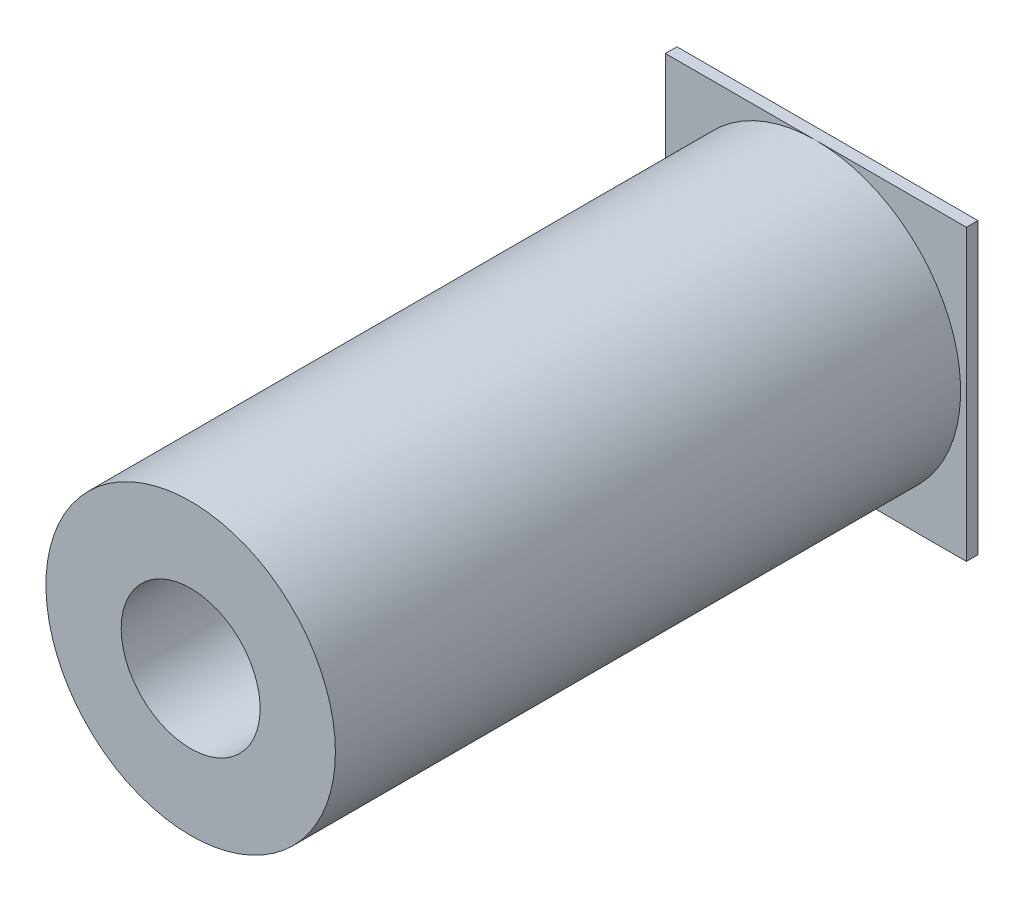
ISO-10303-21;
HEADER;
FILE_DESCRIPTION(('STEP AP214'),'2;1');
FILE_NAME('part.step','',(''),(''),'','','');
FILE_SCHEMA(('AUTOMOTIVE_DESIGN { 1 0 10303 214 1 1 1 1 }'));
ENDSEC;
DATA;
#1=APPLICATION_CONTEXT('core data for automotive mechanical design processes');
#2=APPLICATION_PROTOCOL_DEFINITION('international standard','automotive_design',2000,#1);
#3=PRODUCT_CONTEXT('',#1,'mechanical');
#4=PRODUCT('Part','Part','',(#3));
#5=PRODUCT_RELATED_PRODUCT_CATEGORY('part','',(#4));
#6=PRODUCT_DEFINITION_FORMATION('','',#4);
#7=PRODUCT_DEFINITION_CONTEXT('part definition',#1,'design');
#8=PRODUCT_DEFINITION('design','',#6,#7);
#9=PRODUCT_DEFINITION_SHAPE('','',#8);
#10=(LENGTH_UNIT() NAMED_UNIT(*) SI_UNIT(.MILLI.,.METRE.));
#11=(NAMED_UNIT(*) PLANE_ANGLE_UNIT() SI_UNIT($,.RADIAN.));
#12=(NAMED_UNIT(*) SI_UNIT($,.STERADIAN.) SOLID_ANGLE_UNIT());
#13=UNCERTAINTY_MEASURE_WITH_UNIT(LENGTH_MEASURE(1.E-05),#10,'distance_accuracy_value','');
#14=(GEOMETRIC_REPRESENTATION_CONTEXT(3) GLOBAL_UNCERTAINTY_ASSIGNED_CONTEXT((#13)) GLOBAL_UNIT_ASSIGNED_CONTEXT((#10,
#11,#12)) REPRESENTATION_CONTEXT('',''));
#15=CARTESIAN_POINT('',(0.,0.,0.));
#16=DIRECTION('',(0.,0.,1.));
#17=DIRECTION('',(1.,0.,0.));
#18=AXIS2_PLACEMENT_3D('',#15,#16,#17);
#19=CARTESIAN_POINT('',(0.,0.,1.));
#20=DIRECTION('',(0.,0.,1.));
#21=DIRECTION('',(1.,0.,0.));
#22=AXIS2_PLACEMENT_3D('',#19,#20,#21);
#23=PLANE('',#22);
#24=CARTESIAN_POINT('',(0.,0.,1.));
#25=DIRECTION('',(0.,0.,1.));
#26=DIRECTION('',(1.,0.,0.));
#27=AXIS2_PLACEMENT_3D('',#24,#25,#26);
#28=CIRCLE('',#27,12.5);
#29=CARTESIAN_POINT('',(0.,12.5,1.));
#30=VERTEX_POINT('',#29);
#31=CARTESIAN_POINT('',(0.,-12.5,1.));
#32=VERTEX_POINT('',#31);
#33=EDGE_CURVE('E54',#30,#32,#28,.T.);
#34=ORIENTED_EDGE('',*,*,#33,.F.);
#35=DIRECTION('',(-1.,0.,0.));
#36=VECTOR('',#35,1.);
#37=CARTESIAN_POINT('',(-13.,12.5,1.));
#38=LINE('',#37,#36);
#39=CARTESIAN_POINT('',(-13.,12.5,1.));
#40=VERTEX_POINT('',#39);
#41=EDGE_CURVE('E102',#30,#40,#38,.T.);
#42=ORIENTED_EDGE('',*,*,#41,.T.);
#43=DIRECTION('',(0.,-1.,0.));
#44=VECTOR('',#43,1.);
#45=CARTESIAN_POINT('',(-13.,12.5,1.));
#46=LINE('',#45,#44);
#47=CARTESIAN_POINT('',(-13.,-12.5,1.));
#48=VERTEX_POINT('',#47);
#49=EDGE_CURVE('E101',#40,#48,#46,.T.);
#50=ORIENTED_EDGE('',*,*,#49,.T.);
#51=DIRECTION('',(1.,0.,0.));
#52=VECTOR('',#51,1.);
#53=CARTESIAN_POINT('',(-13.,-12.5,1.));
#54=LINE('',#53,#52);
#55=EDGE_CURVE('E115',#48,#32,#54,.T.);
#56=ORIENTED_EDGE('',*,*,#55,.T.);
#57=EDGE_LOOP('',(#34,#42,#50,#56));
#58=FACE_BOUND('',#57,.T.);
#59=ADVANCED_FACE('F43',(#58),#23,.T.);
#60=CARTESIAN_POINT('',(13.,12.5,1.));
#61=DIRECTION('',(-1.,0.,0.));
#62=DIRECTION('',(0.,-1.,0.));
#63=AXIS2_PLACEMENT_3D('',#60,#61,#62);
#64=PLANE('',#63);
#65=DIRECTION('',(0.,1.,0.));
#66=VECTOR('',#65,1.);
#67=CARTESIAN_POINT('',(13.,12.5,0.));
#68=LINE('',#67,#66);
#69=CARTESIAN_POINT('',(13.,-12.5,0.));
#70=VERTEX_POINT('',#69);
#71=CARTESIAN_POINT('',(13.,12.5,0.));
#72=VERTEX_POINT('',#71);
#73=EDGE_CURVE('E243',#70,#72,#68,.T.);
#74=ORIENTED_EDGE('',*,*,#73,.T.);
#75=DIRECTION('',(0.,0.,-1.));
#76=VECTOR('',#75,1.);
#77=CARTESIAN_POINT('',(13.,12.5,1.));
#78=LINE('',#77,#76);
#79=CARTESIAN_POINT('',(13.,12.5,1.));
#80=VERTEX_POINT('',#79);
#81=EDGE_CURVE('E47',#80,#72,#78,.T.);
#82=ORIENTED_EDGE('',*,*,#81,.F.);
#83=DIRECTION('',(0.,1.,0.));
#84=VECTOR('',#83,1.);
#85=CARTESIAN_POINT('',(13.,12.5,1.));
#86=LINE('',#85,#84);
#87=CARTESIAN_POINT('',(13.,-12.5,1.));
#88=VERTEX_POINT('',#87);
#89=EDGE_CURVE('E98',#88,#80,#86,.T.);
#90=ORIENTED_EDGE('',*,*,#89,.F.);
#91=DIRECTION('',(0.,0.,-1.));
#92=VECTOR('',#91,1.);
#93=CARTESIAN_POINT('',(13.,-12.5,1.));
#94=LINE('',#93,#92);
#95=EDGE_CURVE('E251',#88,#70,#94,.T.);
#96=ORIENTED_EDGE('',*,*,#95,.T.);
#97=EDGE_LOOP('',(#74,#82,#90,#96));
#98=FACE_BOUND('',#97,.T.);
#99=ADVANCED_FACE('F45',(#98),#64,.F.);
#100=CARTESIAN_POINT('',(-13.,12.5,1.));
#101=DIRECTION('',(0.,-1.,0.));
#102=DIRECTION('',(0.,0.,-1.));
#103=AXIS2_PLACEMENT_3D('',#100,#101,#102);
#104=PLANE('',#103);
#105=DIRECTION('',(-1.,0.,0.));
#106=VECTOR('',#105,1.);
#107=CARTESIAN_POINT('',(-13.,12.5,0.));
#108=LINE('',#107,#106);
#109=CARTESIAN_POINT('',(-13.,12.5,0.));
#110=VERTEX_POINT('',#109);
#111=EDGE_CURVE('E255',#72,#110,#108,.T.);
#112=ORIENTED_EDGE('',*,*,#111,.T.);
#113=DIRECTION('',(0.,0.,-1.));
#114=VECTOR('',#113,1.);
#115=CARTESIAN_POINT('',(-13.,12.5,1.));
#116=LINE('',#115,#114);
#117=EDGE_CURVE('E108',#40,#110,#116,.T.);
#118=ORIENTED_EDGE('',*,*,#117,.F.);
#119=ORIENTED_EDGE('',*,*,#41,.F.);
#120=EDGE_CURVE('E93',#80,#30,#38,.T.);
#121=ORIENTED_EDGE('',*,*,#120,.F.);
#122=ORIENTED_EDGE('',*,*,#81,.T.);
#123=EDGE_LOOP('',(#112,#118,#119,#121,#122));
#124=FACE_BOUND('',#123,.T.);
#125=ADVANCED_FACE('F106',(#124),#104,.F.);
#126=CARTESIAN_POINT('',(-13.,12.5,1.));
#127=DIRECTION('',(1.,0.,0.));
#128=DIRECTION('',(0.,1.,0.));
#129=AXIS2_PLACEMENT_3D('',#126,#127,#128);
#130=PLANE('',#129);
#131=DIRECTION('',(0.,-1.,0.));
#132=VECTOR('',#131,1.);
#133=CARTESIAN_POINT('',(-13.,12.5,0.));
#134=LINE('',#133,#132);
#135=CARTESIAN_POINT('',(-13.,-12.5,0.));
#136=VERTEX_POINT('',#135);
#137=EDGE_CURVE('E258',#110,#136,#134,.T.);
#138=ORIENTED_EDGE('',*,*,#137,.T.);
#139=DIRECTION('',(0.,0.,-1.));
#140=VECTOR('',#139,1.);
#141=CARTESIAN_POINT('',(-13.,-12.5,1.));
#142=LINE('',#141,#140);
#143=EDGE_CURVE('E265',#48,#136,#142,.T.);
#144=ORIENTED_EDGE('',*,*,#143,.F.);
#145=ORIENTED_EDGE('',*,*,#49,.F.);
#146=ORIENTED_EDGE('',*,*,#117,.T.);
#147=EDGE_LOOP('',(#138,#144,#145,#146));
#148=FACE_BOUND('',#147,.T.);
#149=ADVANCED_FACE('F147',(#148),#130,.F.);
#150=CARTESIAN_POINT('',(-13.,-12.5,1.));
#151=DIRECTION('',(0.,1.,0.));
#152=DIRECTION('',(0.,0.,1.));
#153=AXIS2_PLACEMENT_3D('',#150,#151,#152);
#154=PLANE('',#153);
#155=DIRECTION('',(1.,0.,0.));
#156=VECTOR('',#155,1.);
#157=CARTESIAN_POINT('',(-13.,-12.5,0.));
#158=LINE('',#157,#156);
#159=EDGE_CURVE('E86',#136,#70,#158,.T.);
#160=ORIENTED_EDGE('',*,*,#159,.T.);
#161=ORIENTED_EDGE('',*,*,#95,.F.);
#162=EDGE_CURVE('E64',#32,#88,#54,.T.);
#163=ORIENTED_EDGE('',*,*,#162,.F.);
#164=ORIENTED_EDGE('',*,*,#55,.F.);
#165=ORIENTED_EDGE('',*,*,#143,.T.);
#166=EDGE_LOOP('',(#160,#161,#163,#164,#165));
#167=FACE_BOUND('',#166,.T.);
#168=ADVANCED_FACE('F143',(#167),#154,.F.);
#169=EDGE_CURVE('E11',#32,#30,#28,.T.);
#170=ORIENTED_EDGE('',*,*,#169,.F.);
#171=ORIENTED_EDGE('',*,*,#162,.T.);
#172=ORIENTED_EDGE('',*,*,#89,.T.);
#173=ORIENTED_EDGE('',*,*,#120,.T.);
#174=EDGE_LOOP('',(#170,#171,#172,#173));
#175=FACE_BOUND('',#174,.T.);
#176=ADVANCED_FACE('F96',(#175),#23,.T.);
#177=CARTESIAN_POINT('',(0.,0.,0.));
#178=DIRECTION('',(0.,0.,1.));
#179=DIRECTION('',(1.,0.,0.));
#180=AXIS2_PLACEMENT_3D('',#177,#178,#179);
#181=PLANE('',#180);
#182=CARTESIAN_POINT('',(0.,0.,0.));
#183=DIRECTION('',(0.,0.,-1.));
#184=DIRECTION('',(-1.,0.,0.));
#185=AXIS2_PLACEMENT_3D('',#182,#183,#184);
#186=CIRCLE('',#185,6.);
#187=CARTESIAN_POINT('',(-6.,0.,0.));
#188=VERTEX_POINT('',#187);
#189=EDGE_CURVE('E235',#188,#188,#186,.T.);
#190=ORIENTED_EDGE('',*,*,#189,.F.);
#191=EDGE_LOOP('',(#190));
#192=FACE_BOUND('',#191,.T.);
#193=ORIENTED_EDGE('',*,*,#73,.F.);
#194=ORIENTED_EDGE('',*,*,#159,.F.);
#195=ORIENTED_EDGE('',*,*,#137,.F.);
#196=ORIENTED_EDGE('',*,*,#111,.F.);
#197=EDGE_LOOP('',(#193,#194,#195,#196));
#198=FACE_BOUND('',#197,.T.);
#199=ADVANCED_FACE('F123',(#192,#198),#181,.F.);
#200=CARTESIAN_POINT('',(0.,0.,55.));
#201=DIRECTION('',(0.,0.,-1.));
#202=DIRECTION('',(-1.,0.,0.));
#203=AXIS2_PLACEMENT_3D('',#200,#201,#202);
#204=CYLINDRICAL_SURFACE('',#203,12.5);
#205=CARTESIAN_POINT('',(0.,0.,55.));
#206=DIRECTION('',(0.,0.,1.));
#207=DIRECTION('',(1.,0.,0.));
#208=AXIS2_PLACEMENT_3D('',#205,#206,#207);
#209=CIRCLE('',#208,12.5);
#210=CARTESIAN_POINT('',(12.5,0.,55.));
#211=VERTEX_POINT('',#210);
#212=EDGE_CURVE('E118',#211,#211,#209,.T.);
#213=ORIENTED_EDGE('',*,*,#212,.F.);
#214=EDGE_LOOP('',(#213));
#215=FACE_BOUND('',#214,.T.);
#216=ORIENTED_EDGE('',*,*,#33,.T.);
#217=ORIENTED_EDGE('',*,*,#169,.T.);
#218=EDGE_LOOP('',(#216,#217));
#219=FACE_BOUND('',#218,.T.);
#220=ADVANCED_FACE('F120',(#215,#219),#204,.T.);
#221=CARTESIAN_POINT('',(0.,0.,55.));
#222=DIRECTION('',(0.,0.,1.));
#223=DIRECTION('',(1.,0.,0.));
#224=AXIS2_PLACEMENT_3D('',#221,#222,#223);
#225=PLANE('',#224);
#226=CARTESIAN_POINT('',(0.,0.,55.));
#227=DIRECTION('',(0.,0.,-1.));
#228=DIRECTION('',(-1.,0.,0.));
#229=AXIS2_PLACEMENT_3D('',#226,#227,#228);
#230=CIRCLE('',#229,6.);
#231=CARTESIAN_POINT('',(-6.,0.,55.));
#232=VERTEX_POINT('',#231);
#233=EDGE_CURVE('E119',#232,#232,#230,.T.);
#234=ORIENTED_EDGE('',*,*,#233,.T.);
#235=EDGE_LOOP('',(#234));
#236=FACE_BOUND('',#235,.T.);
#237=ORIENTED_EDGE('',*,*,#212,.T.);
#238=EDGE_LOOP('',(#237));
#239=FACE_BOUND('',#238,.T.);
#240=ADVANCED_FACE('F122',(#236,#239),#225,.T.);
#241=CARTESIAN_POINT('',(0.,0.,55.));
#242=DIRECTION('',(0.,0.,-1.));
#243=DIRECTION('',(-1.,0.,0.));
#244=AXIS2_PLACEMENT_3D('',#241,#242,#243);
#245=CYLINDRICAL_SURFACE('',#244,6.);
#246=ORIENTED_EDGE('',*,*,#233,.F.);
#247=EDGE_LOOP('',(#246));
#248=FACE_BOUND('',#247,.T.);
#249=ORIENTED_EDGE('',*,*,#189,.T.);
#250=EDGE_LOOP('',(#249));
#251=FACE_BOUND('',#250,.T.);
#252=ADVANCED_FACE('F130',(#248,#251),#245,.F.);
#253=CLOSED_SHELL('',(#59,#99,#125,#149,#168,#176,#199,#220,#240,#252));
#254=MANIFOLD_SOLID_BREP('B2',#253);
#255=ADVANCED_BREP_SHAPE_REPRESENTATION('',(#18,#254),#14);
#256=SHAPE_DEFINITION_REPRESENTATION(#9,#255);
ENDSEC;
END-ISO-10303-21;
